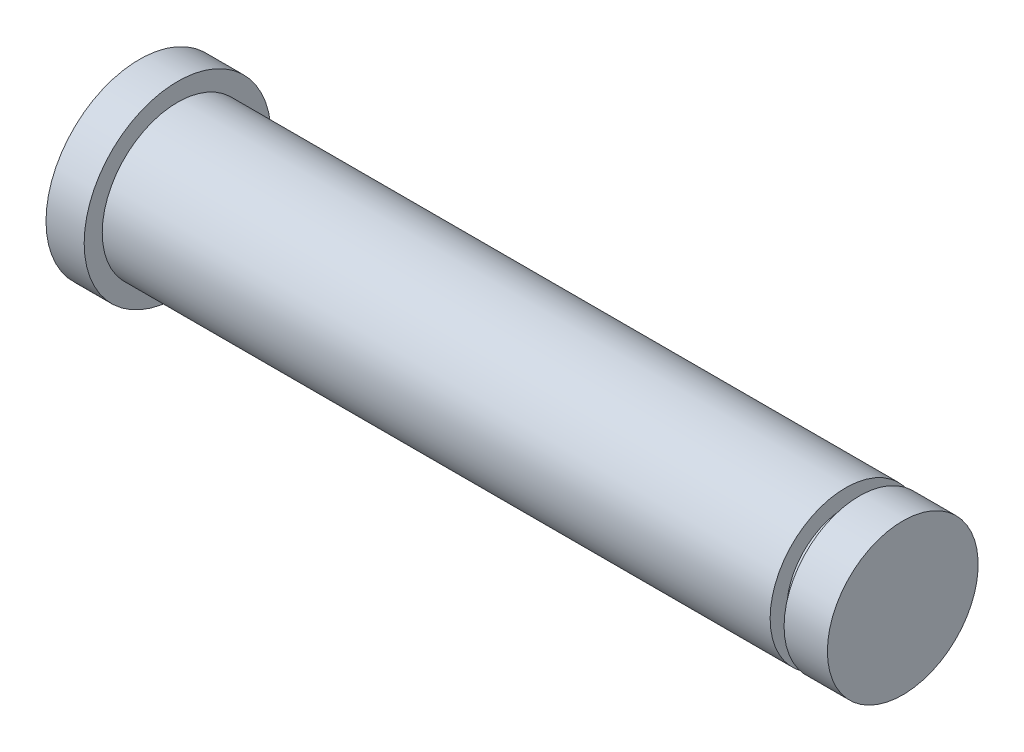
ISO-10303-21;
HEADER;
FILE_DESCRIPTION(('STEP AP214'),'2;1');
FILE_NAME('part.step','',(''),(''),'','','');
FILE_SCHEMA(('AUTOMOTIVE_DESIGN { 1 0 10303 214 1 1 1 1 }'));
ENDSEC;
DATA;
#1=APPLICATION_CONTEXT('core data for automotive mechanical design processes');
#2=APPLICATION_PROTOCOL_DEFINITION('international standard','automotive_design',2000,#1);
#3=PRODUCT_CONTEXT('',#1,'mechanical');
#4=PRODUCT('Part','Part','',(#3));
#5=PRODUCT_RELATED_PRODUCT_CATEGORY('part','',(#4));
#6=PRODUCT_DEFINITION_FORMATION('','',#4);
#7=PRODUCT_DEFINITION_CONTEXT('part definition',#1,'design');
#8=PRODUCT_DEFINITION('design','',#6,#7);
#9=PRODUCT_DEFINITION_SHAPE('','',#8);
#10=(LENGTH_UNIT() NAMED_UNIT(*) SI_UNIT(.MILLI.,.METRE.));
#11=(NAMED_UNIT(*) PLANE_ANGLE_UNIT() SI_UNIT($,.RADIAN.));
#12=(NAMED_UNIT(*) SI_UNIT($,.STERADIAN.) SOLID_ANGLE_UNIT());
#13=UNCERTAINTY_MEASURE_WITH_UNIT(LENGTH_MEASURE(1.E-05),#10,'distance_accuracy_value','');
#14=(GEOMETRIC_REPRESENTATION_CONTEXT(3) GLOBAL_UNCERTAINTY_ASSIGNED_CONTEXT((#13)) GLOBAL_UNIT_ASSIGNED_CONTEXT((#10,
#11,#12)) REPRESENTATION_CONTEXT('',''));
#15=CARTESIAN_POINT('',(0.,0.,0.));
#16=DIRECTION('',(0.,0.,1.));
#17=DIRECTION('',(1.,0.,0.));
#18=AXIS2_PLACEMENT_3D('',#15,#16,#17);
#19=CARTESIAN_POINT('',(0.,0.,0.));
#20=DIRECTION('',(1.,0.,0.));
#21=DIRECTION('',(0.,0.,-1.));
#22=AXIS2_PLACEMENT_3D('',#19,#20,#21);
#23=PLANE('',#22);
#24=CARTESIAN_POINT('',(0.,0.,0.));
#25=DIRECTION('',(-1.,0.,0.));
#26=DIRECTION('',(0.,0.,1.));
#27=AXIS2_PLACEMENT_3D('',#24,#25,#26);
#28=CIRCLE('',#27,4.89664155494938);
#29=CARTESIAN_POINT('',(0.,0.,4.89664155494938));
#30=VERTEX_POINT('',#29);
#31=EDGE_CURVE('E10',#30,#30,#28,.T.);
#32=ORIENTED_EDGE('',*,*,#31,.T.);
#33=EDGE_LOOP('',(#32));
#34=FACE_BOUND('',#33,.T.);
#35=ADVANCED_FACE('F35',(#34),#23,.F.);
#36=CARTESIAN_POINT('',(0.,0.,0.));
#37=DIRECTION('',(-1.,0.,0.));
#38=DIRECTION('',(0.,0.,1.));
#39=AXIS2_PLACEMENT_3D('',#36,#37,#38);
#40=CYLINDRICAL_SURFACE('',#39,4.89664155494938);
#41=ORIENTED_EDGE('',*,*,#31,.F.);
#42=EDGE_LOOP('',(#41));
#43=FACE_BOUND('',#42,.T.);
#44=CARTESIAN_POINT('',(2.,0.,0.));
#45=DIRECTION('',(-1.,0.,0.));
#46=DIRECTION('',(0.,0.,1.));
#47=AXIS2_PLACEMENT_3D('',#44,#45,#46);
#48=CIRCLE('',#47,4.89664155494938);
#49=CARTESIAN_POINT('',(2.,0.,4.89664155494938));
#50=VERTEX_POINT('',#49);
#51=EDGE_CURVE('E41',#50,#50,#48,.T.);
#52=ORIENTED_EDGE('',*,*,#51,.T.);
#53=EDGE_LOOP('',(#52));
#54=FACE_BOUND('',#53,.T.);
#55=ADVANCED_FACE('F79',(#43,#54),#40,.T.);
#56=CARTESIAN_POINT('',(2.,4.89664155494938,0.));
#57=DIRECTION('',(-1.,0.,0.));
#58=DIRECTION('',(0.,0.,1.));
#59=AXIS2_PLACEMENT_3D('',#56,#57,#58);
#60=PLANE('',#59);
#61=ORIENTED_EDGE('',*,*,#51,.F.);
#62=EDGE_LOOP('',(#61));
#63=FACE_BOUND('',#62,.T.);
#64=CARTESIAN_POINT('',(2.,0.,0.));
#65=DIRECTION('',(-1.,0.,0.));
#66=DIRECTION('',(0.,0.,1.));
#67=AXIS2_PLACEMENT_3D('',#64,#65,#66);
#68=CIRCLE('',#67,3.95);
#69=CARTESIAN_POINT('',(2.,0.,3.95));
#70=VERTEX_POINT('',#69);
#71=EDGE_CURVE('E45',#70,#70,#68,.T.);
#72=ORIENTED_EDGE('',*,*,#71,.T.);
#73=EDGE_LOOP('',(#72));
#74=FACE_BOUND('',#73,.T.);
#75=ADVANCED_FACE('F83',(#63,#74),#60,.F.);
#76=CARTESIAN_POINT('',(0.,0.,0.));
#77=DIRECTION('',(-1.,0.,0.));
#78=DIRECTION('',(0.,0.,1.));
#79=AXIS2_PLACEMENT_3D('',#76,#77,#78);
#80=CYLINDRICAL_SURFACE('',#79,3.95);
#81=ORIENTED_EDGE('',*,*,#71,.F.);
#82=EDGE_LOOP('',(#81));
#83=FACE_BOUND('',#82,.T.);
#84=CARTESIAN_POINT('',(37.,0.,0.));
#85=DIRECTION('',(-1.,0.,0.));
#86=DIRECTION('',(0.,0.,1.));
#87=AXIS2_PLACEMENT_3D('',#84,#85,#86);
#88=CIRCLE('',#87,3.95);
#89=CARTESIAN_POINT('',(37.,0.,3.95));
#90=VERTEX_POINT('',#89);
#91=EDGE_CURVE('E49',#90,#90,#88,.T.);
#92=ORIENTED_EDGE('',*,*,#91,.T.);
#93=EDGE_LOOP('',(#92));
#94=FACE_BOUND('',#93,.T.);
#95=ADVANCED_FACE('F88',(#83,#94),#80,.T.);
#96=CARTESIAN_POINT('',(37.,3.95,0.));
#97=DIRECTION('',(-1.,0.,0.));
#98=DIRECTION('',(0.,0.,1.));
#99=AXIS2_PLACEMENT_3D('',#96,#97,#98);
#100=PLANE('',#99);
#101=ORIENTED_EDGE('',*,*,#91,.F.);
#102=EDGE_LOOP('',(#101));
#103=FACE_BOUND('',#102,.T.);
#104=CARTESIAN_POINT('',(37.,0.,0.));
#105=DIRECTION('',(-1.,0.,0.));
#106=DIRECTION('',(0.,0.,1.));
#107=AXIS2_PLACEMENT_3D('',#104,#105,#106);
#108=CIRCLE('',#107,3.08);
#109=CARTESIAN_POINT('',(37.,0.,3.08));
#110=VERTEX_POINT('',#109);
#111=EDGE_CURVE('E54',#110,#110,#108,.T.);
#112=ORIENTED_EDGE('',*,*,#111,.T.);
#113=EDGE_LOOP('',(#112));
#114=FACE_BOUND('',#113,.T.);
#115=ADVANCED_FACE('F94',(#103,#114),#100,.F.);
#116=CARTESIAN_POINT('',(0.,0.,0.));
#117=DIRECTION('',(-1.,0.,0.));
#118=DIRECTION('',(0.,0.,1.));
#119=AXIS2_PLACEMENT_3D('',#116,#117,#118);
#120=CYLINDRICAL_SURFACE('',#119,3.08);
#121=ORIENTED_EDGE('',*,*,#111,.F.);
#122=EDGE_LOOP('',(#121));
#123=FACE_BOUND('',#122,.T.);
#124=CARTESIAN_POINT('',(37.73,0.,0.));
#125=DIRECTION('',(-1.,0.,0.));
#126=DIRECTION('',(0.,0.,1.));
#127=AXIS2_PLACEMENT_3D('',#124,#125,#126);
#128=CIRCLE('',#127,3.08);
#129=CARTESIAN_POINT('',(37.73,0.,3.08));
#130=VERTEX_POINT('',#129);
#131=EDGE_CURVE('E57',#130,#130,#128,.T.);
#132=ORIENTED_EDGE('',*,*,#131,.T.);
#133=EDGE_LOOP('',(#132));
#134=FACE_BOUND('',#133,.T.);
#135=ADVANCED_FACE('F98',(#123,#134),#120,.T.);
#136=CARTESIAN_POINT('',(37.73,3.08,0.));
#137=DIRECTION('',(1.,0.,0.));
#138=DIRECTION('',(0.,0.,-1.));
#139=AXIS2_PLACEMENT_3D('',#136,#137,#138);
#140=PLANE('',#139);
#141=ORIENTED_EDGE('',*,*,#131,.F.);
#142=EDGE_LOOP('',(#141));
#143=FACE_BOUND('',#142,.T.);
#144=CARTESIAN_POINT('',(37.73,0.,0.));
#145=DIRECTION('',(-1.,0.,0.));
#146=DIRECTION('',(0.,0.,1.));
#147=AXIS2_PLACEMENT_3D('',#144,#145,#146);
#148=CIRCLE('',#147,3.95);
#149=CARTESIAN_POINT('',(37.73,0.,3.95));
#150=VERTEX_POINT('',#149);
#151=EDGE_CURVE('E60',#150,#150,#148,.T.);
#152=ORIENTED_EDGE('',*,*,#151,.T.);
#153=EDGE_LOOP('',(#152));
#154=FACE_BOUND('',#153,.T.);
#155=ADVANCED_FACE('F75',(#143,#154),#140,.F.);
#156=CARTESIAN_POINT('',(0.,0.,0.));
#157=DIRECTION('',(-1.,0.,0.));
#158=DIRECTION('',(0.,0.,1.));
#159=AXIS2_PLACEMENT_3D('',#156,#157,#158);
#160=CYLINDRICAL_SURFACE('',#159,3.95);
#161=ORIENTED_EDGE('',*,*,#151,.F.);
#162=EDGE_LOOP('',(#161));
#163=FACE_BOUND('',#162,.T.);
#164=CARTESIAN_POINT('',(40.,0.,0.));
#165=DIRECTION('',(-1.,0.,0.));
#166=DIRECTION('',(0.,0.,1.));
#167=AXIS2_PLACEMENT_3D('',#164,#165,#166);
#168=CIRCLE('',#167,3.95);
#169=CARTESIAN_POINT('',(40.,0.,3.95));
#170=VERTEX_POINT('',#169);
#171=EDGE_CURVE('E63',#170,#170,#168,.T.);
#172=ORIENTED_EDGE('',*,*,#171,.T.);
#173=EDGE_LOOP('',(#172));
#174=FACE_BOUND('',#173,.T.);
#175=ADVANCED_FACE('F67',(#163,#174),#160,.T.);
#176=CARTESIAN_POINT('',(40.,3.95,0.));
#177=DIRECTION('',(-1.,0.,0.));
#178=DIRECTION('',(0.,0.,1.));
#179=AXIS2_PLACEMENT_3D('',#176,#177,#178);
#180=PLANE('',#179);
#181=ORIENTED_EDGE('',*,*,#171,.F.);
#182=EDGE_LOOP('',(#181));
#183=FACE_BOUND('',#182,.T.);
#184=ADVANCED_FACE('F69',(#183),#180,.F.);
#185=CLOSED_SHELL('',(#35,#55,#75,#95,#115,#135,#155,#175,#184));
#186=MANIFOLD_SOLID_BREP('B2',#185);
#187=ADVANCED_BREP_SHAPE_REPRESENTATION('',(#18,#186),#14);
#188=SHAPE_DEFINITION_REPRESENTATION(#9,#187);
ENDSEC;
END-ISO-10303-21;
